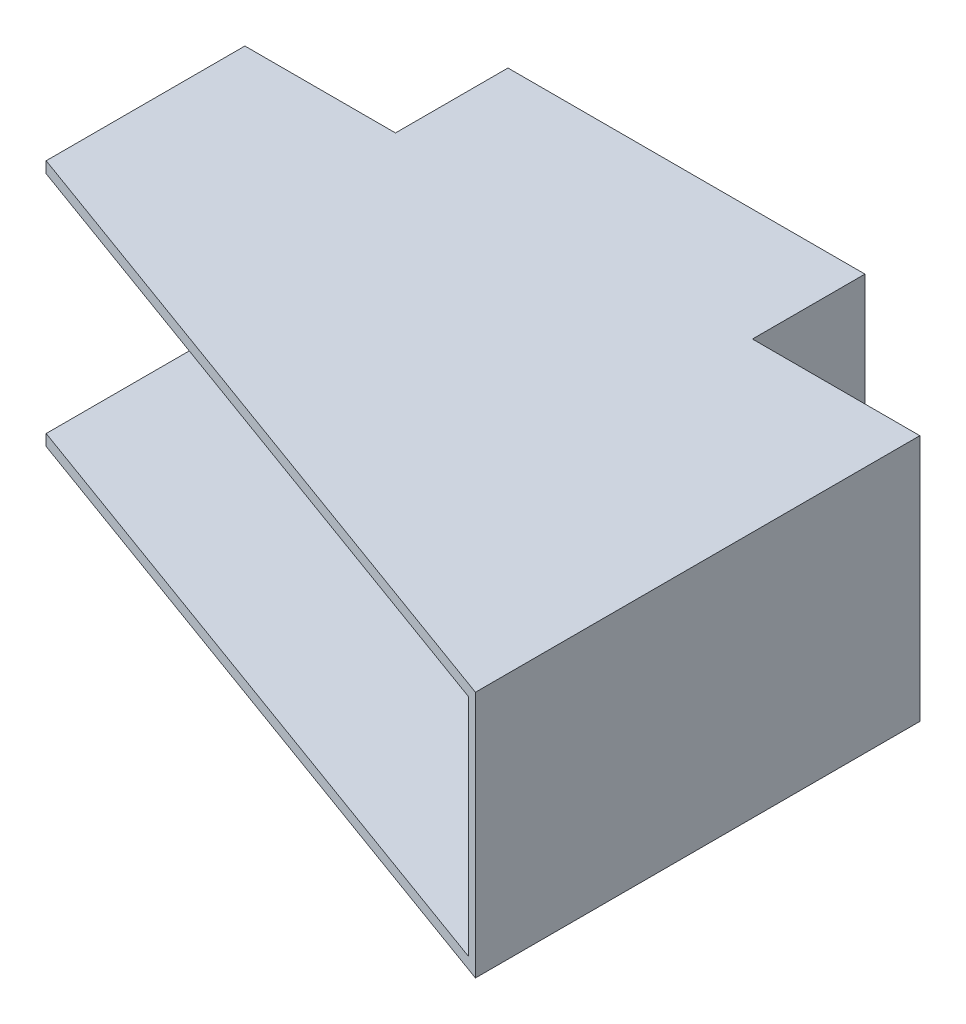
ISO-10303-21;
HEADER;
FILE_DESCRIPTION(('STEP AP214'),'2;1');
FILE_NAME('part.step','',(''),(''),'','','');
FILE_SCHEMA(('AUTOMOTIVE_DESIGN { 1 0 10303 214 1 1 1 1 }'));
ENDSEC;
DATA;
#1=APPLICATION_CONTEXT('core data for automotive mechanical design processes');
#2=APPLICATION_PROTOCOL_DEFINITION('international standard','automotive_design',2000,#1);
#3=PRODUCT_CONTEXT('',#1,'mechanical');
#4=PRODUCT('Part','Part','',(#3));
#5=PRODUCT_RELATED_PRODUCT_CATEGORY('part','',(#4));
#6=PRODUCT_DEFINITION_FORMATION('','',#4);
#7=PRODUCT_DEFINITION_CONTEXT('part definition',#1,'design');
#8=PRODUCT_DEFINITION('design','',#6,#7);
#9=PRODUCT_DEFINITION_SHAPE('','',#8);
#10=(LENGTH_UNIT() NAMED_UNIT(*) SI_UNIT(.MILLI.,.METRE.));
#11=(NAMED_UNIT(*) PLANE_ANGLE_UNIT() SI_UNIT($,.RADIAN.));
#12=(NAMED_UNIT(*) SI_UNIT($,.STERADIAN.) SOLID_ANGLE_UNIT());
#13=UNCERTAINTY_MEASURE_WITH_UNIT(LENGTH_MEASURE(1.E-05),#10,'distance_accuracy_value','');
#14=(GEOMETRIC_REPRESENTATION_CONTEXT(3) GLOBAL_UNCERTAINTY_ASSIGNED_CONTEXT((#13)) GLOBAL_UNIT_ASSIGNED_CONTEXT((#10,
#11,#12)) REPRESENTATION_CONTEXT('',''));
#15=CARTESIAN_POINT('',(0.,0.,0.));
#16=DIRECTION('',(0.,0.,1.));
#17=DIRECTION('',(1.,0.,0.));
#18=AXIS2_PLACEMENT_3D('',#15,#16,#17);
#19=CARTESIAN_POINT('',(0.,3.,53.));
#20=DIRECTION('',(0.,-1.,0.));
#21=DIRECTION('',(0.,0.,-1.));
#22=AXIS2_PLACEMENT_3D('',#19,#20,#21);
#23=PLANE('',#22);
#24=DIRECTION('',(0.,0.,-1.));
#25=VECTOR('',#24,1.);
#26=CARTESIAN_POINT('',(177.180922137642,3.00000000000003,117.48858173794));
#27=LINE('',#26,#25);
#28=CARTESIAN_POINT('',(177.180922137642,3.00000000000003,117.48858173794));
#29=VERTEX_POINT('',#28);
#30=CARTESIAN_POINT('',(177.180922137642,3.00000000000003,67.4885817379398));
#31=VERTEX_POINT('',#30);
#32=EDGE_CURVE('E257',#29,#31,#27,.T.);
#33=ORIENTED_EDGE('',*,*,#32,.T.);
#34=DIRECTION('',(-0.939692620785908,0.,-0.34202014332567));
#35=VECTOR('',#34,1.);
#36=CARTESIAN_POINT('',(16.0696902421636,3.,8.8488889220256));
#37=LINE('',#36,#35);
#38=CARTESIAN_POINT('',(0.,3.,3.));
#39=VERTEX_POINT('',#38);
#40=EDGE_CURVE('E293',#31,#39,#37,.T.);
#41=ORIENTED_EDGE('',*,*,#40,.T.);
#42=DIRECTION('',(0.,0.,-1.));
#43=VECTOR('',#42,1.);
#44=CARTESIAN_POINT('',(0.,3.,53.));
#45=LINE('',#44,#43);
#46=CARTESIAN_POINT('',(0.,3.,53.));
#47=VERTEX_POINT('',#46);
#48=EDGE_CURVE('E412',#47,#39,#45,.T.);
#49=ORIENTED_EDGE('',*,*,#48,.F.);
#50=DIRECTION('',(-0.939692620785908,0.,-0.34202014332567));
#51=VECTOR('',#50,1.);
#52=CARTESIAN_POINT('',(0.,3.,53.));
#53=LINE('',#52,#51);
#54=EDGE_CURVE('E279',#29,#47,#53,.T.);
#55=ORIENTED_EDGE('',*,*,#54,.F.);
#56=EDGE_LOOP('',(#33,#41,#49,#55));
#57=FACE_BOUND('',#56,.T.);
#58=ADVANCED_FACE('F40',(#57),#23,.F.);
#59=CARTESIAN_POINT('',(180.,63.,53.));
#60=DIRECTION('',(0.,1.,0.));
#61=DIRECTION('',(-1.,0.,0.));
#62=AXIS2_PLACEMENT_3D('',#59,#60,#61);
#63=PLANE('',#62);
#64=DIRECTION('',(0.,0.,-1.));
#65=VECTOR('',#64,1.);
#66=CARTESIAN_POINT('',(177.180922137642,63.,117.48858173794));
#67=LINE('',#66,#65);
#68=CARTESIAN_POINT('',(177.180922137642,63.,117.48858173794));
#69=VERTEX_POINT('',#68);
#70=CARTESIAN_POINT('',(177.180922137642,63.,67.4885817379398));
#71=VERTEX_POINT('',#70);
#72=EDGE_CURVE('E245',#69,#71,#67,.T.);
#73=ORIENTED_EDGE('',*,*,#72,.F.);
#74=DIRECTION('',(0.939692620785908,0.,0.34202014332567));
#75=VECTOR('',#74,1.);
#76=CARTESIAN_POINT('',(180.,63.,118.514642167917));
#77=LINE('',#76,#75);
#78=CARTESIAN_POINT('',(0.,63.,53.));
#79=VERTEX_POINT('',#78);
#80=EDGE_CURVE('E271',#79,#69,#77,.T.);
#81=ORIENTED_EDGE('',*,*,#80,.F.);
#82=DIRECTION('',(0.,0.,-1.));
#83=VECTOR('',#82,1.);
#84=CARTESIAN_POINT('',(0.,63.,53.));
#85=LINE('',#84,#83);
#86=CARTESIAN_POINT('',(0.,63.,3.));
#87=VERTEX_POINT('',#86);
#88=EDGE_CURVE('E406',#79,#87,#85,.T.);
#89=ORIENTED_EDGE('',*,*,#88,.T.);
#90=DIRECTION('',(0.939692620785908,0.,0.34202014332567));
#91=VECTOR('',#90,1.);
#92=CARTESIAN_POINT('',(175.013690122871,63.,66.6997737938144));
#93=LINE('',#92,#91);
#94=EDGE_CURVE('E289',#87,#71,#93,.T.);
#95=ORIENTED_EDGE('',*,*,#94,.T.);
#96=EDGE_LOOP('',(#73,#81,#89,#95));
#97=FACE_BOUND('',#96,.T.);
#98=ADVANCED_FACE('F463',(#97),#63,.F.);
#99=CARTESIAN_POINT('',(0.,66.,3.));
#100=DIRECTION('',(-0.34202014332567,0.,0.939692620785908));
#101=DIRECTION('',(0.939692620785908,0.,0.34202014332567));
#102=AXIS2_PLACEMENT_3D('',#99,#100,#101);
#103=PLANE('',#102);
#104=ORIENTED_EDGE('',*,*,#40,.F.);
#105=DIRECTION('',(0.,1.,0.));
#106=VECTOR('',#105,1.);
#107=CARTESIAN_POINT('',(177.180922137642,3.00000000000003,67.4885817379398));
#108=LINE('',#107,#106);
#109=EDGE_CURVE('E261',#31,#71,#108,.T.);
#110=ORIENTED_EDGE('',*,*,#109,.T.);
#111=ORIENTED_EDGE('',*,*,#94,.F.);
#112=DIRECTION('',(0.,1.,0.));
#113=VECTOR('',#112,1.);
#114=CARTESIAN_POINT('',(0.,0.,3.));
#115=LINE('',#114,#113);
#116=EDGE_CURVE('E416',#39,#87,#115,.T.);
#117=ORIENTED_EDGE('',*,*,#116,.F.);
#118=EDGE_LOOP('',(#104,#110,#111,#117));
#119=FACE_BOUND('',#118,.T.);
#120=ADVANCED_FACE('F469',(#119),#103,.T.);
#121=CARTESIAN_POINT('',(30.,0.,9.));
#122=DIRECTION('',(0.,0.,1.));
#123=DIRECTION('',(0.,-1.,0.));
#124=AXIS2_PLACEMENT_3D('',#121,#122,#123);
#125=PLANE('',#124);
#126=DIRECTION('',(0.,-1.,0.));
#127=VECTOR('',#126,1.);
#128=CARTESIAN_POINT('',(8.,-32.,9.));
#129=LINE('',#128,#127);
#130=CARTESIAN_POINT('',(8.,-27.5,9.00000000000001));
#131=VERTEX_POINT('',#130);
#132=CARTESIAN_POINT('',(8.,-32.,9.00000000000001));
#133=VERTEX_POINT('',#132);
#134=EDGE_CURVE('E308',#131,#133,#129,.T.);
#135=ORIENTED_EDGE('',*,*,#134,.F.);
#136=DIRECTION('',(-1.,0.,0.));
#137=VECTOR('',#136,1.);
#138=CARTESIAN_POINT('',(8.,-27.5,9.));
#139=LINE('',#138,#137);
#140=CARTESIAN_POINT('',(30.,-27.5,9.));
#141=VERTEX_POINT('',#140);
#142=EDGE_CURVE('E302',#141,#131,#139,.T.);
#143=ORIENTED_EDGE('',*,*,#142,.F.);
#144=DIRECTION('',(0.,1.,0.));
#145=VECTOR('',#144,1.);
#146=CARTESIAN_POINT('',(30.,0.,9.));
#147=LINE('',#146,#145);
#148=CARTESIAN_POINT('',(30.,-5.,9.));
#149=VERTEX_POINT('',#148);
#150=EDGE_CURVE('E380',#141,#149,#147,.T.);
#151=ORIENTED_EDGE('',*,*,#150,.T.);
#152=DIRECTION('',(1.,0.,0.));
#153=VECTOR('',#152,1.);
#154=CARTESIAN_POINT('',(30.,-5.,9.));
#155=LINE('',#154,#153);
#156=CARTESIAN_POINT('',(8.,-5.,9.));
#157=VERTEX_POINT('',#156);
#158=EDGE_CURVE('E342',#157,#149,#155,.T.);
#159=ORIENTED_EDGE('',*,*,#158,.F.);
#160=DIRECTION('',(0.,-1.,0.));
#161=VECTOR('',#160,1.);
#162=CARTESIAN_POINT('',(8.,-5.,9.));
#163=LINE('',#162,#161);
#164=CARTESIAN_POINT('',(8.,0.,9.));
#165=VERTEX_POINT('',#164);
#166=EDGE_CURVE('E336',#165,#157,#163,.T.);
#167=ORIENTED_EDGE('',*,*,#166,.F.);
#168=DIRECTION('',(-1.,0.,0.));
#169=VECTOR('',#168,1.);
#170=CARTESIAN_POINT('',(30.,0.,9.));
#171=LINE('',#170,#169);
#172=CARTESIAN_POINT('',(0.,0.,9.));
#173=VERTEX_POINT('',#172);
#174=EDGE_CURVE('E394',#165,#173,#171,.T.);
#175=ORIENTED_EDGE('',*,*,#174,.T.);
#176=DIRECTION('',(0.,1.,0.));
#177=VECTOR('',#176,1.);
#178=CARTESIAN_POINT('',(0.,0.,9.));
#179=LINE('',#178,#177);
#180=CARTESIAN_POINT('',(0.,-32.,9.00000000000001));
#181=VERTEX_POINT('',#180);
#182=EDGE_CURVE('E377',#181,#173,#179,.T.);
#183=ORIENTED_EDGE('',*,*,#182,.F.);
#184=DIRECTION('',(-1.,0.,0.));
#185=VECTOR('',#184,1.);
#186=CARTESIAN_POINT('',(30.,-32.,9.00000000000001));
#187=LINE('',#186,#185);
#188=EDGE_CURVE('E398',#133,#181,#187,.T.);
#189=ORIENTED_EDGE('',*,*,#188,.F.);
#190=EDGE_LOOP('',(#135,#143,#151,#159,#167,#175,#183,#189));
#191=FACE_BOUND('',#190,.T.);
#192=ADVANCED_FACE('F478',(#191),#125,.T.);
#193=CARTESIAN_POINT('',(0.,0.,3.));
#194=DIRECTION('',(0.,1.,0.));
#195=DIRECTION('',(0.,0.,1.));
#196=AXIS2_PLACEMENT_3D('',#193,#194,#195);
#197=PLANE('',#196);
#198=DIRECTION('',(0.,0.,-1.));
#199=VECTOR('',#198,1.);
#200=CARTESIAN_POINT('',(30.,0.,0.));
#201=LINE('',#200,#199);
#202=CARTESIAN_POINT('',(30.,0.,21.));
#203=VERTEX_POINT('',#202);
#204=CARTESIAN_POINT('',(30.,0.,0.));
#205=VERTEX_POINT('',#204);
#206=EDGE_CURVE('E383',#203,#205,#201,.T.);
#207=ORIENTED_EDGE('',*,*,#206,.T.);
#208=DIRECTION('',(-1.,0.,0.));
#209=VECTOR('',#208,1.);
#210=CARTESIAN_POINT('',(0.,0.,0.));
#211=LINE('',#210,#209);
#212=CARTESIAN_POINT('',(40.1572772217982,0.,0.));
#213=VERTEX_POINT('',#212);
#214=EDGE_CURVE('E210',#213,#205,#211,.T.);
#215=ORIENTED_EDGE('',*,*,#214,.F.);
#216=DIRECTION('',(0.,0.,1.));
#217=VECTOR('',#216,1.);
#218=CARTESIAN_POINT('',(40.1572772217982,0.,0.));
#219=LINE('',#218,#217);
#220=CARTESIAN_POINT('',(40.1572772217982,0.,-30.));
#221=VERTEX_POINT('',#220);
#222=EDGE_CURVE('E188',#221,#213,#219,.T.);
#223=ORIENTED_EDGE('',*,*,#222,.F.);
#224=DIRECTION('',(-1.,0.,0.));
#225=VECTOR('',#224,1.);
#226=CARTESIAN_POINT('',(180.,0.,-30.));
#227=LINE('',#226,#225);
#228=CARTESIAN_POINT('',(135.361229185655,0.,-30.));
#229=VERTEX_POINT('',#228);
#230=EDGE_CURVE('E298',#229,#221,#227,.T.);
#231=ORIENTED_EDGE('',*,*,#230,.F.);
#232=DIRECTION('',(0.,0.,-1.));
#233=VECTOR('',#232,1.);
#234=CARTESIAN_POINT('',(135.361229185655,0.,-30.));
#235=LINE('',#234,#233);
#236=CARTESIAN_POINT('',(135.361229185655,0.,0.));
#237=VERTEX_POINT('',#236);
#238=EDGE_CURVE('E58',#237,#229,#235,.T.);
#239=ORIENTED_EDGE('',*,*,#238,.F.);
#240=DIRECTION('',(-1.,0.,0.));
#241=VECTOR('',#240,1.);
#242=CARTESIAN_POINT('',(135.361229185655,0.,0.));
#243=LINE('',#242,#241);
#244=CARTESIAN_POINT('',(180.,0.,0.));
#245=VERTEX_POINT('',#244);
#246=EDGE_CURVE('E228',#245,#237,#243,.T.);
#247=ORIENTED_EDGE('',*,*,#246,.F.);
#248=DIRECTION('',(0.,0.,-1.));
#249=VECTOR('',#248,1.);
#250=CARTESIAN_POINT('',(180.,0.,3.));
#251=LINE('',#250,#249);
#252=CARTESIAN_POINT('',(180.,0.,118.514642167917));
#253=VERTEX_POINT('',#252);
#254=EDGE_CURVE('E50',#253,#245,#251,.T.);
#255=ORIENTED_EDGE('',*,*,#254,.F.);
#256=DIRECTION('',(-0.939692620785908,0.,-0.34202014332567));
#257=VECTOR('',#256,1.);
#258=CARTESIAN_POINT('',(0.,0.,53.));
#259=LINE('',#258,#257);
#260=CARTESIAN_POINT('',(0.,0.,53.));
#261=VERTEX_POINT('',#260);
#262=EDGE_CURVE('E275',#253,#261,#259,.T.);
#263=ORIENTED_EDGE('',*,*,#262,.T.);
#264=DIRECTION('',(0.,0.,-1.));
#265=VECTOR('',#264,1.);
#266=CARTESIAN_POINT('',(0.,0.,3.));
#267=LINE('',#266,#265);
#268=EDGE_CURVE('E11',#261,#173,#267,.T.);
#269=ORIENTED_EDGE('',*,*,#268,.T.);
#270=ORIENTED_EDGE('',*,*,#174,.F.);
#271=DIRECTION('',(0.,0.,-1.));
#272=VECTOR('',#271,1.);
#273=CARTESIAN_POINT('',(8.,0.,21.));
#274=LINE('',#273,#272);
#275=CARTESIAN_POINT('',(8.,0.,21.));
#276=VERTEX_POINT('',#275);
#277=EDGE_CURVE('E353',#276,#165,#274,.T.);
#278=ORIENTED_EDGE('',*,*,#277,.F.);
#279=DIRECTION('',(-1.,0.,0.));
#280=VECTOR('',#279,1.);
#281=CARTESIAN_POINT('',(8.,0.,21.));
#282=LINE('',#281,#280);
#283=EDGE_CURVE('E349',#203,#276,#282,.T.);
#284=ORIENTED_EDGE('',*,*,#283,.F.);
#285=EDGE_LOOP('',(#207,#215,#223,#231,#239,#247,#255,#263,#269,#270,#278,#284));
#286=FACE_BOUND('',#285,.T.);
#287=ADVANCED_FACE('F443',(#286),#197,.F.);
#288=CARTESIAN_POINT('',(0.,0.,3.));
#289=DIRECTION('',(-1.,0.,0.));
#290=DIRECTION('',(0.,0.,1.));
#291=AXIS2_PLACEMENT_3D('',#288,#289,#290);
#292=PLANE('',#291);
#293=DIRECTION('',(0.,0.,-1.));
#294=VECTOR('',#293,1.);
#295=CARTESIAN_POINT('',(0.,66.,3.));
#296=LINE('',#295,#294);
#297=CARTESIAN_POINT('',(0.,66.,53.));
#298=VERTEX_POINT('',#297);
#299=CARTESIAN_POINT('',(0.,66.,0.));
#300=VERTEX_POINT('',#299);
#301=EDGE_CURVE('E44',#298,#300,#296,.T.);
#302=ORIENTED_EDGE('',*,*,#301,.T.);
#303=DIRECTION('',(0.,1.,0.));
#304=VECTOR('',#303,1.);
#305=CARTESIAN_POINT('',(0.,0.,0.));
#306=LINE('',#305,#304);
#307=CARTESIAN_POINT('',(0.,-32.,0.));
#308=VERTEX_POINT('',#307);
#309=EDGE_CURVE('E199',#308,#300,#306,.T.);
#310=ORIENTED_EDGE('',*,*,#309,.F.);
#311=DIRECTION('',(0.,0.,1.));
#312=VECTOR('',#311,1.);
#313=CARTESIAN_POINT('',(0.,-32.,0.));
#314=LINE('',#313,#312);
#315=EDGE_CURVE('E371',#308,#181,#314,.T.);
#316=ORIENTED_EDGE('',*,*,#315,.T.);
#317=ORIENTED_EDGE('',*,*,#182,.T.);
#318=ORIENTED_EDGE('',*,*,#268,.F.);
#319=DIRECTION('',(0.,-1.,0.));
#320=VECTOR('',#319,1.);
#321=CARTESIAN_POINT('',(0.,0.,53.));
#322=LINE('',#321,#320);
#323=EDGE_CURVE('E409',#47,#261,#322,.T.);
#324=ORIENTED_EDGE('',*,*,#323,.F.);
#325=ORIENTED_EDGE('',*,*,#48,.T.);
#326=ORIENTED_EDGE('',*,*,#116,.T.);
#327=ORIENTED_EDGE('',*,*,#88,.F.);
#328=DIRECTION('',(0.,-1.,0.));
#329=VECTOR('',#328,1.);
#330=CARTESIAN_POINT('',(0.,63.,53.));
#331=LINE('',#330,#329);
#332=EDGE_CURVE('E397',#298,#79,#331,.T.);
#333=ORIENTED_EDGE('',*,*,#332,.F.);
#334=EDGE_LOOP('',(#302,#310,#316,#317,#318,#324,#325,#326,#327,#333));
#335=FACE_BOUND('',#334,.T.);
#336=ADVANCED_FACE('F42',(#335),#292,.T.);
#337=CARTESIAN_POINT('',(180.,0.,3.));
#338=DIRECTION('',(-1.,0.,0.));
#339=DIRECTION('',(0.,0.,1.));
#340=AXIS2_PLACEMENT_3D('',#337,#338,#339);
#341=PLANE('',#340);
#342=ORIENTED_EDGE('',*,*,#254,.T.);
#343=DIRECTION('',(0.,-1.,0.));
#344=VECTOR('',#343,1.);
#345=CARTESIAN_POINT('',(180.,66.,0.));
#346=LINE('',#345,#344);
#347=CARTESIAN_POINT('',(180.,66.,0.));
#348=VERTEX_POINT('',#347);
#349=EDGE_CURVE('E227',#348,#245,#346,.T.);
#350=ORIENTED_EDGE('',*,*,#349,.F.);
#351=DIRECTION('',(0.,0.,-1.));
#352=VECTOR('',#351,1.);
#353=CARTESIAN_POINT('',(180.,66.,3.));
#354=LINE('',#353,#352);
#355=CARTESIAN_POINT('',(180.,66.,118.514642167917));
#356=VERTEX_POINT('',#355);
#357=EDGE_CURVE('E424',#356,#348,#354,.T.);
#358=ORIENTED_EDGE('',*,*,#357,.F.);
#359=DIRECTION('',(0.,-1.,0.));
#360=VECTOR('',#359,1.);
#361=CARTESIAN_POINT('',(180.,3.,118.514642167917));
#362=LINE('',#361,#360);
#363=EDGE_CURVE('E282',#356,#253,#362,.T.);
#364=ORIENTED_EDGE('',*,*,#363,.T.);
#365=EDGE_LOOP('',(#342,#350,#358,#364));
#366=FACE_BOUND('',#365,.T.);
#367=ADVANCED_FACE('F438',(#366),#341,.F.);
#368=CARTESIAN_POINT('',(0.,66.,3.));
#369=DIRECTION('',(0.,1.,0.));
#370=DIRECTION('',(0.,0.,1.));
#371=AXIS2_PLACEMENT_3D('',#368,#369,#370);
#372=PLANE('',#371);
#373=DIRECTION('',(-1.,0.,0.));
#374=VECTOR('',#373,1.);
#375=CARTESIAN_POINT('',(0.,66.,0.));
#376=LINE('',#375,#374);
#377=CARTESIAN_POINT('',(40.1572772217982,66.,0.));
#378=VERTEX_POINT('',#377);
#379=EDGE_CURVE('E196',#378,#300,#376,.T.);
#380=ORIENTED_EDGE('',*,*,#379,.T.);
#381=ORIENTED_EDGE('',*,*,#301,.F.);
#382=DIRECTION('',(0.939692620785908,0.,0.34202014332567));
#383=VECTOR('',#382,1.);
#384=CARTESIAN_POINT('',(180.,66.,118.514642167917));
#385=LINE('',#384,#383);
#386=EDGE_CURVE('E270',#298,#356,#385,.T.);
#387=ORIENTED_EDGE('',*,*,#386,.T.);
#388=ORIENTED_EDGE('',*,*,#357,.T.);
#389=DIRECTION('',(-1.,0.,0.));
#390=VECTOR('',#389,1.);
#391=CARTESIAN_POINT('',(135.361229185655,66.,0.));
#392=LINE('',#391,#390);
#393=CARTESIAN_POINT('',(135.361229185655,66.,0.));
#394=VERTEX_POINT('',#393);
#395=EDGE_CURVE('E220',#348,#394,#392,.T.);
#396=ORIENTED_EDGE('',*,*,#395,.T.);
#397=DIRECTION('',(0.,0.,-1.));
#398=VECTOR('',#397,1.);
#399=CARTESIAN_POINT('',(135.361229185655,66.,-30.));
#400=LINE('',#399,#398);
#401=CARTESIAN_POINT('',(135.361229185655,66.,-30.));
#402=VERTEX_POINT('',#401);
#403=EDGE_CURVE('E224',#394,#402,#400,.T.);
#404=ORIENTED_EDGE('',*,*,#403,.T.);
#405=DIRECTION('',(1.,0.,0.));
#406=VECTOR('',#405,1.);
#407=CARTESIAN_POINT('',(0.,66.,-30.));
#408=LINE('',#407,#406);
#409=CARTESIAN_POINT('',(40.1572772217982,66.,-30.));
#410=VERTEX_POINT('',#409);
#411=EDGE_CURVE('E208',#410,#402,#408,.T.);
#412=ORIENTED_EDGE('',*,*,#411,.F.);
#413=DIRECTION('',(0.,0.,1.));
#414=VECTOR('',#413,1.);
#415=CARTESIAN_POINT('',(40.1572772217982,66.,0.));
#416=LINE('',#415,#414);
#417=EDGE_CURVE('E66',#410,#378,#416,.T.);
#418=ORIENTED_EDGE('',*,*,#417,.T.);
#419=EDGE_LOOP('',(#380,#381,#387,#388,#396,#404,#412,#418));
#420=FACE_BOUND('',#419,.T.);
#421=ADVANCED_FACE('F205',(#420),#372,.T.);
#422=CARTESIAN_POINT('',(0.,0.,0.));
#423=DIRECTION('',(0.,0.,-1.));
#424=DIRECTION('',(-1.,0.,0.));
#425=AXIS2_PLACEMENT_3D('',#422,#423,#424);
#426=PLANE('',#425);
#427=ORIENTED_EDGE('',*,*,#309,.T.);
#428=ORIENTED_EDGE('',*,*,#379,.F.);
#429=DIRECTION('',(0.,-1.,0.));
#430=VECTOR('',#429,1.);
#431=CARTESIAN_POINT('',(40.1572772217982,66.,0.));
#432=LINE('',#431,#430);
#433=EDGE_CURVE('E184',#378,#213,#432,.T.);
#434=ORIENTED_EDGE('',*,*,#433,.T.);
#435=ORIENTED_EDGE('',*,*,#214,.T.);
#436=DIRECTION('',(0.,-1.,0.));
#437=VECTOR('',#436,1.);
#438=CARTESIAN_POINT('',(30.,0.,0.));
#439=LINE('',#438,#437);
#440=CARTESIAN_POINT('',(30.,-32.,0.));
#441=VERTEX_POINT('',#440);
#442=EDGE_CURVE('E372',#205,#441,#439,.T.);
#443=ORIENTED_EDGE('',*,*,#442,.T.);
#444=DIRECTION('',(-1.,0.,0.));
#445=VECTOR('',#444,1.);
#446=CARTESIAN_POINT('',(30.,-32.,0.));
#447=LINE('',#446,#445);
#448=EDGE_CURVE('E387',#441,#308,#447,.T.);
#449=ORIENTED_EDGE('',*,*,#448,.T.);
#450=EDGE_LOOP('',(#427,#428,#434,#435,#443,#449));
#451=FACE_BOUND('',#450,.T.);
#452=ADVANCED_FACE('F197',(#451),#426,.T.);
#453=CARTESIAN_POINT('',(30.,-32.,0.));
#454=DIRECTION('',(0.,-1.,0.));
#455=DIRECTION('',(0.,0.,-1.));
#456=AXIS2_PLACEMENT_3D('',#453,#454,#455);
#457=PLANE('',#456);
#458=ORIENTED_EDGE('',*,*,#315,.F.);
#459=ORIENTED_EDGE('',*,*,#448,.F.);
#460=DIRECTION('',(0.,0.,1.));
#461=VECTOR('',#460,1.);
#462=CARTESIAN_POINT('',(30.,-32.,0.));
#463=LINE('',#462,#461);
#464=CARTESIAN_POINT('',(30.,-32.,21.));
#465=VERTEX_POINT('',#464);
#466=EDGE_CURVE('E376',#441,#465,#463,.T.);
#467=ORIENTED_EDGE('',*,*,#466,.T.);
#468=DIRECTION('',(1.,0.,0.));
#469=VECTOR('',#468,1.);
#470=CARTESIAN_POINT('',(30.,-32.,21.));
#471=LINE('',#470,#469);
#472=CARTESIAN_POINT('',(8.,-32.,21.));
#473=VERTEX_POINT('',#472);
#474=EDGE_CURVE('E311',#473,#465,#471,.T.);
#475=ORIENTED_EDGE('',*,*,#474,.F.);
#476=DIRECTION('',(0.,0.,-1.));
#477=VECTOR('',#476,1.);
#478=CARTESIAN_POINT('',(8.,-32.,21.));
#479=LINE('',#478,#477);
#480=EDGE_CURVE('E328',#473,#133,#479,.T.);
#481=ORIENTED_EDGE('',*,*,#480,.T.);
#482=ORIENTED_EDGE('',*,*,#188,.T.);
#483=EDGE_LOOP('',(#458,#459,#467,#475,#481,#482));
#484=FACE_BOUND('',#483,.T.);
#485=ADVANCED_FACE('F475',(#484),#457,.T.);
#486=CARTESIAN_POINT('',(30.,0.,0.));
#487=DIRECTION('',(-1.,0.,0.));
#488=DIRECTION('',(0.,0.,1.));
#489=AXIS2_PLACEMENT_3D('',#486,#487,#488);
#490=PLANE('',#489);
#491=ORIENTED_EDGE('',*,*,#442,.F.);
#492=ORIENTED_EDGE('',*,*,#206,.F.);
#493=DIRECTION('',(0.,1.,0.));
#494=VECTOR('',#493,1.);
#495=CARTESIAN_POINT('',(30.,0.,21.));
#496=LINE('',#495,#494);
#497=CARTESIAN_POINT('',(30.,-5.,21.));
#498=VERTEX_POINT('',#497);
#499=EDGE_CURVE('E345',#498,#203,#496,.T.);
#500=ORIENTED_EDGE('',*,*,#499,.F.);
#501=DIRECTION('',(0.,0.,-1.));
#502=VECTOR('',#501,1.);
#503=CARTESIAN_POINT('',(30.,-5.,21.));
#504=LINE('',#503,#502);
#505=EDGE_CURVE('E363',#498,#149,#504,.T.);
#506=ORIENTED_EDGE('',*,*,#505,.T.);
#507=ORIENTED_EDGE('',*,*,#150,.F.);
#508=DIRECTION('',(0.,0.,-1.));
#509=VECTOR('',#508,1.);
#510=CARTESIAN_POINT('',(30.,-27.5,21.));
#511=LINE('',#510,#509);
#512=CARTESIAN_POINT('',(30.,-27.5,21.));
#513=VERTEX_POINT('',#512);
#514=EDGE_CURVE('E318',#513,#141,#511,.T.);
#515=ORIENTED_EDGE('',*,*,#514,.F.);
#516=DIRECTION('',(0.,1.,0.));
#517=VECTOR('',#516,1.);
#518=CARTESIAN_POINT('',(30.,-27.5,21.));
#519=LINE('',#518,#517);
#520=EDGE_CURVE('E315',#465,#513,#519,.T.);
#521=ORIENTED_EDGE('',*,*,#520,.F.);
#522=ORIENTED_EDGE('',*,*,#466,.F.);
#523=EDGE_LOOP('',(#491,#492,#500,#506,#507,#515,#521,#522));
#524=FACE_BOUND('',#523,.T.);
#525=ADVANCED_FACE('F499',(#524),#490,.F.);
#526=CARTESIAN_POINT('',(8.,-5.,21.));
#527=DIRECTION('',(1.,0.,0.));
#528=DIRECTION('',(0.,0.,-1.));
#529=AXIS2_PLACEMENT_3D('',#526,#527,#528);
#530=PLANE('',#529);
#531=CARTESIAN_POINT('',(8.,-2.5,15.));
#532=DIRECTION('',(-1.,0.,0.));
#533=DIRECTION('',(0.,0.,1.));
#534=AXIS2_PLACEMENT_3D('',#531,#532,#533);
#535=CIRCLE('',#534,1.);
#536=CARTESIAN_POINT('',(8.,-2.5,16.));
#537=VERTEX_POINT('',#536);
#538=EDGE_CURVE('E246',#537,#537,#535,.T.);
#539=ORIENTED_EDGE('',*,*,#538,.F.);
#540=EDGE_LOOP('',(#539));
#541=FACE_BOUND('',#540,.T.);
#542=ORIENTED_EDGE('',*,*,#166,.T.);
#543=DIRECTION('',(0.,0.,-1.));
#544=VECTOR('',#543,1.);
#545=CARTESIAN_POINT('',(8.,-5.,21.));
#546=LINE('',#545,#544);
#547=CARTESIAN_POINT('',(8.,-5.,21.));
#548=VERTEX_POINT('',#547);
#549=EDGE_CURVE('E367',#548,#157,#546,.T.);
#550=ORIENTED_EDGE('',*,*,#549,.F.);
#551=DIRECTION('',(0.,-1.,0.));
#552=VECTOR('',#551,1.);
#553=CARTESIAN_POINT('',(8.,-5.,21.));
#554=LINE('',#553,#552);
#555=EDGE_CURVE('E337',#276,#548,#554,.T.);
#556=ORIENTED_EDGE('',*,*,#555,.F.);
#557=ORIENTED_EDGE('',*,*,#277,.T.);
#558=EDGE_LOOP('',(#542,#550,#556,#557));
#559=FACE_BOUND('',#558,.T.);
#560=ADVANCED_FACE('F503',(#541,#559),#530,.F.);
#561=CARTESIAN_POINT('',(30.,-5.,21.));
#562=DIRECTION('',(0.,1.,0.));
#563=DIRECTION('',(0.,0.,1.));
#564=AXIS2_PLACEMENT_3D('',#561,#562,#563);
#565=PLANE('',#564);
#566=ORIENTED_EDGE('',*,*,#158,.T.);
#567=ORIENTED_EDGE('',*,*,#505,.F.);
#568=DIRECTION('',(1.,0.,0.));
#569=VECTOR('',#568,1.);
#570=CARTESIAN_POINT('',(30.,-5.,21.));
#571=LINE('',#570,#569);
#572=EDGE_CURVE('E341',#548,#498,#571,.T.);
#573=ORIENTED_EDGE('',*,*,#572,.F.);
#574=ORIENTED_EDGE('',*,*,#549,.T.);
#575=EDGE_LOOP('',(#566,#567,#573,#574));
#576=FACE_BOUND('',#575,.T.);
#577=ADVANCED_FACE('F666',(#576),#565,.F.);
#578=CARTESIAN_POINT('',(0.,0.,21.));
#579=DIRECTION('',(0.,0.,-1.));
#580=DIRECTION('',(-1.,0.,0.));
#581=AXIS2_PLACEMENT_3D('',#578,#579,#580);
#582=PLANE('',#581);
#583=ORIENTED_EDGE('',*,*,#555,.T.);
#584=ORIENTED_EDGE('',*,*,#572,.T.);
#585=ORIENTED_EDGE('',*,*,#499,.T.);
#586=ORIENTED_EDGE('',*,*,#283,.T.);
#587=EDGE_LOOP('',(#583,#584,#585,#586));
#588=FACE_BOUND('',#587,.T.);
#589=ADVANCED_FACE('F671',(#588),#582,.F.);
#590=CARTESIAN_POINT('',(8.,-27.5,21.));
#591=DIRECTION('',(0.,-1.,0.));
#592=DIRECTION('',(0.,0.,-1.));
#593=AXIS2_PLACEMENT_3D('',#590,#591,#592);
#594=PLANE('',#593);
#595=ORIENTED_EDGE('',*,*,#142,.T.);
#596=DIRECTION('',(0.,0.,-1.));
#597=VECTOR('',#596,1.);
#598=CARTESIAN_POINT('',(8.,-27.5,21.));
#599=LINE('',#598,#597);
#600=CARTESIAN_POINT('',(8.,-27.5,21.));
#601=VERTEX_POINT('',#600);
#602=EDGE_CURVE('E332',#601,#131,#599,.T.);
#603=ORIENTED_EDGE('',*,*,#602,.F.);
#604=DIRECTION('',(-1.,0.,0.));
#605=VECTOR('',#604,1.);
#606=CARTESIAN_POINT('',(8.,-27.5,21.));
#607=LINE('',#606,#605);
#608=EDGE_CURVE('E303',#513,#601,#607,.T.);
#609=ORIENTED_EDGE('',*,*,#608,.F.);
#610=ORIENTED_EDGE('',*,*,#514,.T.);
#611=EDGE_LOOP('',(#595,#603,#609,#610));
#612=FACE_BOUND('',#611,.T.);
#613=ADVANCED_FACE('F681',(#612),#594,.F.);
#614=CARTESIAN_POINT('',(8.,-32.,21.));
#615=DIRECTION('',(1.,0.,0.));
#616=DIRECTION('',(0.,0.,-1.));
#617=AXIS2_PLACEMENT_3D('',#614,#615,#616);
#618=PLANE('',#617);
#619=CARTESIAN_POINT('',(8.,-30.,15.));
#620=DIRECTION('',(-1.,0.,0.));
#621=DIRECTION('',(0.,0.,1.));
#622=AXIS2_PLACEMENT_3D('',#619,#620,#621);
#623=CIRCLE('',#622,1.);
#624=CARTESIAN_POINT('',(8.,-30.,16.));
#625=VERTEX_POINT('',#624);
#626=EDGE_CURVE('E192',#625,#625,#623,.T.);
#627=ORIENTED_EDGE('',*,*,#626,.F.);
#628=EDGE_LOOP('',(#627));
#629=FACE_BOUND('',#628,.T.);
#630=ORIENTED_EDGE('',*,*,#134,.T.);
#631=ORIENTED_EDGE('',*,*,#480,.F.);
#632=DIRECTION('',(0.,-1.,0.));
#633=VECTOR('',#632,1.);
#634=CARTESIAN_POINT('',(8.,-32.,21.));
#635=LINE('',#634,#633);
#636=EDGE_CURVE('E307',#601,#473,#635,.T.);
#637=ORIENTED_EDGE('',*,*,#636,.F.);
#638=ORIENTED_EDGE('',*,*,#602,.T.);
#639=EDGE_LOOP('',(#630,#631,#637,#638));
#640=FACE_BOUND('',#639,.T.);
#641=ADVANCED_FACE('F690',(#629,#640),#618,.F.);
#642=CARTESIAN_POINT('',(0.,0.,21.));
#643=DIRECTION('',(0.,0.,-1.));
#644=DIRECTION('',(-1.,0.,0.));
#645=AXIS2_PLACEMENT_3D('',#642,#643,#644);
#646=PLANE('',#645);
#647=ORIENTED_EDGE('',*,*,#608,.T.);
#648=ORIENTED_EDGE('',*,*,#636,.T.);
#649=ORIENTED_EDGE('',*,*,#474,.T.);
#650=ORIENTED_EDGE('',*,*,#520,.T.);
#651=EDGE_LOOP('',(#647,#648,#649,#650));
#652=FACE_BOUND('',#651,.T.);
#653=ADVANCED_FACE('F511',(#652),#646,.F.);
#654=CARTESIAN_POINT('',(0.,0.,-30.));
#655=DIRECTION('',(0.,0.,-1.));
#656=DIRECTION('',(-1.,0.,0.));
#657=AXIS2_PLACEMENT_3D('',#654,#655,#656);
#658=PLANE('',#657);
#659=DIRECTION('',(0.,-1.,0.));
#660=VECTOR('',#659,1.);
#661=CARTESIAN_POINT('',(40.1572772217982,66.,-30.));
#662=LINE('',#661,#660);
#663=EDGE_CURVE('E193',#410,#221,#662,.T.);
#664=ORIENTED_EDGE('',*,*,#663,.F.);
#665=ORIENTED_EDGE('',*,*,#411,.T.);
#666=DIRECTION('',(0.,-1.,0.));
#667=VECTOR('',#666,1.);
#668=CARTESIAN_POINT('',(135.361229185655,66.,-30.));
#669=LINE('',#668,#667);
#670=EDGE_CURVE('E216',#402,#229,#669,.T.);
#671=ORIENTED_EDGE('',*,*,#670,.T.);
#672=ORIENTED_EDGE('',*,*,#230,.T.);
#673=EDGE_LOOP('',(#664,#665,#671,#672));
#674=FACE_BOUND('',#673,.T.);
#675=ADVANCED_FACE('F446',(#674),#658,.T.);
#676=CARTESIAN_POINT('',(0.,3.,53.));
#677=DIRECTION('',(-0.34202014332567,0.,0.939692620785908));
#678=DIRECTION('',(0.939692620785908,0.,0.34202014332567));
#679=AXIS2_PLACEMENT_3D('',#676,#677,#678);
#680=PLANE('',#679);
#681=ORIENTED_EDGE('',*,*,#262,.F.);
#682=ORIENTED_EDGE('',*,*,#363,.F.);
#683=ORIENTED_EDGE('',*,*,#386,.F.);
#684=ORIENTED_EDGE('',*,*,#332,.T.);
#685=ORIENTED_EDGE('',*,*,#80,.T.);
#686=DIRECTION('',(0.,1.,0.));
#687=VECTOR('',#686,1.);
#688=CARTESIAN_POINT('',(177.180922137642,3.00000000000003,117.48858173794));
#689=LINE('',#688,#687);
#690=EDGE_CURVE('E267',#29,#69,#689,.T.);
#691=ORIENTED_EDGE('',*,*,#690,.F.);
#692=ORIENTED_EDGE('',*,*,#54,.T.);
#693=ORIENTED_EDGE('',*,*,#323,.T.);
#694=EDGE_LOOP('',(#681,#682,#683,#684,#685,#691,#692,#693));
#695=FACE_BOUND('',#694,.T.);
#696=ADVANCED_FACE('F434',(#695),#680,.T.);
#697=CARTESIAN_POINT('',(177.180922137642,3.00000000000003,117.48858173794));
#698=DIRECTION('',(1.,0.,0.));
#699=DIRECTION('',(0.,1.,0.));
#700=AXIS2_PLACEMENT_3D('',#697,#698,#699);
#701=PLANE('',#700);
#702=ORIENTED_EDGE('',*,*,#72,.T.);
#703=ORIENTED_EDGE('',*,*,#109,.F.);
#704=ORIENTED_EDGE('',*,*,#32,.F.);
#705=ORIENTED_EDGE('',*,*,#690,.T.);
#706=EDGE_LOOP('',(#702,#703,#704,#705));
#707=FACE_BOUND('',#706,.T.);
#708=ADVANCED_FACE('F543',(#707),#701,.F.);
#709=CARTESIAN_POINT('',(23.,-30.,15.));
#710=DIRECTION('',(-1.,0.,0.));
#711=DIRECTION('',(0.,0.,1.));
#712=AXIS2_PLACEMENT_3D('',#709,#710,#711);
#713=CYLINDRICAL_SURFACE('',#712,1.);
#714=CARTESIAN_POINT('',(23.,-30.,15.));
#715=DIRECTION('',(-1.,0.,0.));
#716=DIRECTION('',(0.,0.,1.));
#717=AXIS2_PLACEMENT_3D('',#714,#715,#716);
#718=CIRCLE('',#717,1.);
#719=CARTESIAN_POINT('',(23.,-30.,16.));
#720=VERTEX_POINT('',#719);
#721=EDGE_CURVE('E250',#720,#720,#718,.T.);
#722=ORIENTED_EDGE('',*,*,#721,.F.);
#723=EDGE_LOOP('',(#722));
#724=FACE_BOUND('',#723,.T.);
#725=ORIENTED_EDGE('',*,*,#626,.T.);
#726=EDGE_LOOP('',(#725));
#727=FACE_BOUND('',#726,.T.);
#728=ADVANCED_FACE('F551',(#724,#727),#713,.F.);
#729=CARTESIAN_POINT('',(23.,-30.,15.));
#730=DIRECTION('',(-1.,0.,0.));
#731=DIRECTION('',(0.,0.,1.));
#732=AXIS2_PLACEMENT_3D('',#729,#730,#731);
#733=PLANE('',#732);
#734=ORIENTED_EDGE('',*,*,#721,.T.);
#735=EDGE_LOOP('',(#734));
#736=FACE_BOUND('',#735,.T.);
#737=ADVANCED_FACE('F560',(#736),#733,.T.);
#738=CARTESIAN_POINT('',(23.,-2.5,15.));
#739=DIRECTION('',(-1.,0.,0.));
#740=DIRECTION('',(0.,0.,1.));
#741=AXIS2_PLACEMENT_3D('',#738,#739,#740);
#742=CYLINDRICAL_SURFACE('',#741,1.);
#743=CARTESIAN_POINT('',(23.,-2.5,15.));
#744=DIRECTION('',(-1.,0.,0.));
#745=DIRECTION('',(0.,0.,1.));
#746=AXIS2_PLACEMENT_3D('',#743,#744,#745);
#747=CIRCLE('',#746,1.);
#748=CARTESIAN_POINT('',(23.,-2.5,16.));
#749=VERTEX_POINT('',#748);
#750=EDGE_CURVE('E241',#749,#749,#747,.T.);
#751=ORIENTED_EDGE('',*,*,#750,.F.);
#752=EDGE_LOOP('',(#751));
#753=FACE_BOUND('',#752,.T.);
#754=ORIENTED_EDGE('',*,*,#538,.T.);
#755=EDGE_LOOP('',(#754));
#756=FACE_BOUND('',#755,.T.);
#757=ADVANCED_FACE('F458',(#753,#756),#742,.F.);
#758=CARTESIAN_POINT('',(23.,-2.5,15.));
#759=DIRECTION('',(-1.,0.,0.));
#760=DIRECTION('',(0.,0.,1.));
#761=AXIS2_PLACEMENT_3D('',#758,#759,#760);
#762=PLANE('',#761);
#763=ORIENTED_EDGE('',*,*,#750,.T.);
#764=EDGE_LOOP('',(#763));
#765=FACE_BOUND('',#764,.T.);
#766=ADVANCED_FACE('F450',(#765),#762,.T.);
#767=CARTESIAN_POINT('',(135.361229185655,66.,-30.));
#768=DIRECTION('',(-1.,0.,0.));
#769=DIRECTION('',(0.,0.,1.));
#770=AXIS2_PLACEMENT_3D('',#767,#768,#769);
#771=PLANE('',#770);
#772=ORIENTED_EDGE('',*,*,#238,.T.);
#773=ORIENTED_EDGE('',*,*,#670,.F.);
#774=ORIENTED_EDGE('',*,*,#403,.F.);
#775=DIRECTION('',(0.,-1.,0.));
#776=VECTOR('',#775,1.);
#777=CARTESIAN_POINT('',(135.361229185655,66.,0.));
#778=LINE('',#777,#776);
#779=EDGE_CURVE('E236',#394,#237,#778,.T.);
#780=ORIENTED_EDGE('',*,*,#779,.T.);
#781=EDGE_LOOP('',(#772,#773,#774,#780));
#782=FACE_BOUND('',#781,.T.);
#783=ADVANCED_FACE('F448',(#782),#771,.F.);
#784=CARTESIAN_POINT('',(135.361229185655,66.,0.));
#785=DIRECTION('',(0.,0.,1.));
#786=DIRECTION('',(1.,0.,0.));
#787=AXIS2_PLACEMENT_3D('',#784,#785,#786);
#788=PLANE('',#787);
#789=ORIENTED_EDGE('',*,*,#246,.T.);
#790=ORIENTED_EDGE('',*,*,#779,.F.);
#791=ORIENTED_EDGE('',*,*,#395,.F.);
#792=ORIENTED_EDGE('',*,*,#349,.T.);
#793=EDGE_LOOP('',(#789,#790,#791,#792));
#794=FACE_BOUND('',#793,.T.);
#795=ADVANCED_FACE('F441',(#794),#788,.F.);
#796=CARTESIAN_POINT('',(40.1572772217982,66.,0.));
#797=DIRECTION('',(1.,0.,0.));
#798=DIRECTION('',(0.,0.,-1.));
#799=AXIS2_PLACEMENT_3D('',#796,#797,#798);
#800=PLANE('',#799);
#801=ORIENTED_EDGE('',*,*,#222,.T.);
#802=ORIENTED_EDGE('',*,*,#433,.F.);
#803=ORIENTED_EDGE('',*,*,#417,.F.);
#804=ORIENTED_EDGE('',*,*,#663,.T.);
#805=EDGE_LOOP('',(#801,#802,#803,#804));
#806=FACE_BOUND('',#805,.T.);
#807=ADVANCED_FACE('F186',(#806),#800,.F.);
#808=CLOSED_SHELL('',(#58,#98,#120,#192,#287,#336,#367,#421,#452,#485,#525,#560,#577,#589,#613,
#641,#653,#675,#696,#708,#728,#737,#757,#766,#783,#795,#807));
#809=MANIFOLD_SOLID_BREP('B2',#808);
#810=ADVANCED_BREP_SHAPE_REPRESENTATION('',(#18,#809),#14);
#811=SHAPE_DEFINITION_REPRESENTATION(#9,#810);
ENDSEC;
END-ISO-10303-21;
